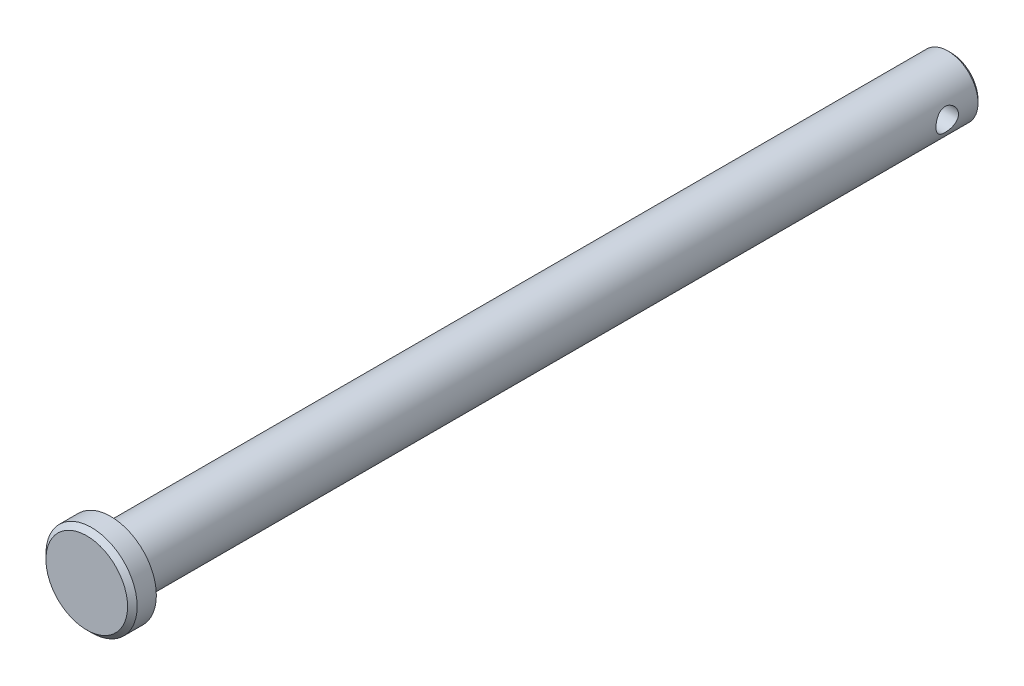
ISO-10303-21;
HEADER;
FILE_DESCRIPTION(('STEP AP214'),'2;1');
FILE_NAME('part.step','',(''),(''),'','','');
FILE_SCHEMA(('AUTOMOTIVE_DESIGN { 1 0 10303 214 1 1 1 1 }'));
ENDSEC;
DATA;
#1=APPLICATION_CONTEXT('core data for automotive mechanical design processes');
#2=APPLICATION_PROTOCOL_DEFINITION('international standard','automotive_design',2000,#1);
#3=PRODUCT_CONTEXT('',#1,'mechanical');
#4=PRODUCT('Part','Part','',(#3));
#5=PRODUCT_RELATED_PRODUCT_CATEGORY('part','',(#4));
#6=PRODUCT_DEFINITION_FORMATION('','',#4);
#7=PRODUCT_DEFINITION_CONTEXT('part definition',#1,'design');
#8=PRODUCT_DEFINITION('design','',#6,#7);
#9=PRODUCT_DEFINITION_SHAPE('','',#8);
#10=(LENGTH_UNIT() NAMED_UNIT(*) SI_UNIT(.MILLI.,.METRE.));
#11=(NAMED_UNIT(*) PLANE_ANGLE_UNIT() SI_UNIT($,.RADIAN.));
#12=(NAMED_UNIT(*) SI_UNIT($,.STERADIAN.) SOLID_ANGLE_UNIT());
#13=UNCERTAINTY_MEASURE_WITH_UNIT(LENGTH_MEASURE(1.E-05),#10,'distance_accuracy_value','');
#14=(GEOMETRIC_REPRESENTATION_CONTEXT(3) GLOBAL_UNCERTAINTY_ASSIGNED_CONTEXT((#13)) GLOBAL_UNIT_ASSIGNED_CONTEXT((#10,
#11,#12)) REPRESENTATION_CONTEXT('',''));
#15=CARTESIAN_POINT('',(0.,0.,0.));
#16=DIRECTION('',(0.,0.,1.));
#17=DIRECTION('',(1.,0.,0.));
#18=AXIS2_PLACEMENT_3D('',#15,#16,#17);
#19=CARTESIAN_POINT('',(0.,0.,44.45));
#20=DIRECTION('',(0.,0.,-1.));
#21=DIRECTION('',(-1.,0.,0.));
#22=AXIS2_PLACEMENT_3D('',#19,#20,#21);
#23=CYLINDRICAL_SURFACE('',#22,3.175);
#24=CARTESIAN_POINT('',(0.,0.,-44.1325));
#25=DIRECTION('',(0.,0.,1.));
#26=DIRECTION('',(1.,0.,0.));
#27=AXIS2_PLACEMENT_3D('',#24,#25,#26);
#28=CIRCLE('',#27,3.175);
#29=CARTESIAN_POINT('',(3.175,0.,-44.1325));
#30=VERTEX_POINT('',#29);
#31=EDGE_CURVE('E41',#30,#30,#28,.T.);
#32=ORIENTED_EDGE('',*,*,#31,.T.);
#33=EDGE_LOOP('',(#32));
#34=FACE_BOUND('',#33,.T.);
#35=CARTESIAN_POINT('',(-3.175,0.,-39.6875));
#36=CARTESIAN_POINT('',(-3.1750017260582,-0.0644803280319207,-39.6874976962969));
#37=CARTESIAN_POINT('',(-3.17301863556027,-0.128944879414297,-39.6927544346972));
#38=CARTESIAN_POINT('',(-3.16530589955499,-0.255947427804687,-39.7135573799955));
#39=CARTESIAN_POINT('',(-3.15957679372107,-0.318485700965171,-39.7291021047485));
#40=CARTESIAN_POINT('',(-3.14498698210789,-0.439785748086512,-39.7698539451563));
#41=CARTESIAN_POINT('',(-3.13613231952368,-0.498554552928811,-39.7950424227273));
#42=CARTESIAN_POINT('',(-3.11617334413749,-0.611028202439704,-39.8542719653313));
#43=CARTESIAN_POINT('',(-3.10506842811866,-0.664731683597443,-39.8883154047757));
#44=CARTESIAN_POINT('',(-3.08122833533403,-0.767831218530126,-39.9657986965375));
#45=CARTESIAN_POINT('',(-3.06844702050705,-0.816983642057511,-40.0095483956684));
#46=CARTESIAN_POINT('',(-3.04292175316615,-0.907450095452761,-40.1045445325105));
#47=CARTESIAN_POINT('',(-3.03017781325932,-0.948761726101174,-40.1557932563948));
#48=CARTESIAN_POINT('',(-3.00563336052824,-1.02392323008938,-40.2667132398466));
#49=CARTESIAN_POINT('',(-2.99388727501525,-1.05742893349134,-40.3266309659457));
#50=CARTESIAN_POINT('',(-2.97338639063463,-1.1137792552768,-40.4517608811213));
#51=CARTESIAN_POINT('',(-2.96463039737105,-1.13662813187984,-40.5169709432544));
#52=CARTESIAN_POINT('',(-2.95159440179158,-1.1700544212018,-40.6480301625799));
#53=CARTESIAN_POINT('',(-2.94714552453477,-1.1810967711723,-40.7137433742581));
#54=CARTESIAN_POINT('',(-2.94273336284839,-1.19205022996996,-40.8462290754076));
#55=CARTESIAN_POINT('',(-2.94276822592073,-1.19196593587088,-40.9130011160129));
#56=CARTESIAN_POINT('',(-2.94717399857943,-1.18102403502952,-41.0414545606378));
#57=CARTESIAN_POINT('',(-2.95128528416453,-1.17081148004022,-41.1032014691726));
#58=CARTESIAN_POINT('',(-2.96294919584751,-1.14096933245487,-41.2240310506342));
#59=CARTESIAN_POINT('',(-2.97050234018473,-1.12133832170211,-41.2831133208748));
#60=CARTESIAN_POINT('',(-2.98835526113513,-1.07286225428949,-41.3982511725093));
#61=CARTESIAN_POINT('',(-2.99870429903107,-1.04384989935074,-41.4542283421088));
#62=CARTESIAN_POINT('',(-3.02096654298085,-0.977551335491415,-41.5607069292128));
#63=CARTESIAN_POINT('',(-3.03288028850369,-0.940262269910621,-41.6112064471563));
#64=CARTESIAN_POINT('',(-3.05790630844421,-0.855517884834488,-41.7088666580229));
#65=CARTESIAN_POINT('',(-3.07104532042938,-0.80754774606584,-41.7555748585938));
#66=CARTESIAN_POINT('',(-3.09635309230243,-0.704304368962601,-41.8404182606759));
#67=CARTESIAN_POINT('',(-3.10852170288599,-0.649030010276034,-41.8785521445933));
#68=CARTESIAN_POINT('',(-3.13075950879707,-0.531592978112733,-41.9456635026684));
#69=CARTESIAN_POINT('',(-3.1407933299357,-0.469337004114246,-41.9744902675942));
#70=CARTESIAN_POINT('',(-3.15736857672026,-0.340389250103888,-42.0211111921394));
#71=CARTESIAN_POINT('',(-3.1639115533356,-0.273699454858827,-42.0389102518954));
#72=CARTESIAN_POINT('',(-3.17249526812277,-0.141585349249252,-42.0621005876114));
#73=CARTESIAN_POINT('',(-3.17475686664138,-0.0762822480275028,-42.0681011938161));
#74=CARTESIAN_POINT('',(-3.17520553124475,0.0544294022336763,-42.0692985319706));
#75=CARTESIAN_POINT('',(-3.17339350069573,0.119837924680553,-42.0644976592515));
#76=CARTESIAN_POINT('',(-3.16604419632035,0.246270501045977,-42.0446914039175));
#77=CARTESIAN_POINT('',(-3.16065273826329,0.307366454105824,-42.0300852121587));
#78=CARTESIAN_POINT('',(-3.1468335994155,0.426197517997295,-41.9916085549156));
#79=CARTESIAN_POINT('',(-3.13840552373861,0.483932190588357,-41.9677368845038));
#80=CARTESIAN_POINT('',(-3.11903764373597,0.596302913556189,-41.9106457851262));
#81=CARTESIAN_POINT('',(-3.1080313141617,0.650798072574004,-41.8771723024289));
#82=CARTESIAN_POINT('',(-3.08472420554452,0.753580464933013,-41.8021150056076));
#83=CARTESIAN_POINT('',(-3.07242294938803,0.801865395464673,-41.7605281972923));
#84=CARTESIAN_POINT('',(-3.04699455283473,0.893786946503484,-41.6675854780639));
#85=CARTESIAN_POINT('',(-3.03386090349835,0.93699134835583,-41.6158027674242));
#86=CARTESIAN_POINT('',(-3.00893809999065,1.01418270962824,-41.5054642133883));
#87=CARTESIAN_POINT('',(-2.99714906660554,1.04816884135274,-41.4469077624604));
#88=CARTESIAN_POINT('',(-2.9762992117158,1.10599357730705,-41.3241998104995));
#89=CARTESIAN_POINT('',(-2.96724991010741,1.12978950323492,-41.2600261079336));
#90=CARTESIAN_POINT('',(-2.95317888607235,1.16608132501844,-41.1281485000728));
#91=CARTESIAN_POINT('',(-2.94815467214383,1.17858421180019,-41.0604468062677));
#92=CARTESIAN_POINT('',(-2.94303366491605,1.1913103800891,-40.9281184233642));
#93=CARTESIAN_POINT('',(-2.94264115340402,1.19227069374821,-40.8635734735747));
#94=CARTESIAN_POINT('',(-2.94606990116576,1.18377268040514,-40.7352934052058));
#95=CARTESIAN_POINT('',(-2.94989076088501,1.17431534131036,-40.6715582104169));
#96=CARTESIAN_POINT('',(-2.96106962383437,1.14582428656504,-40.5486812637937));
#97=CARTESIAN_POINT('',(-2.96831611517726,1.12709164913741,-40.4894586876678));
#98=CARTESIAN_POINT('',(-2.98546478961414,1.08084696819061,-40.3749625026326));
#99=CARTESIAN_POINT('',(-2.99536764396202,1.0533327052505,-40.3196898963443));
#100=CARTESIAN_POINT('',(-3.01735905848772,0.988632102759095,-40.2115124856775));
#101=CARTESIAN_POINT('',(-3.02953498137515,0.951014360373894,-40.1588836800401));
#102=CARTESIAN_POINT('',(-3.0543995836351,0.867842480481129,-40.0604501359791));
#103=CARTESIAN_POINT('',(-3.06708842498621,0.822285820601664,-40.014647575013));
#104=CARTESIAN_POINT('',(-3.09237399534093,0.721582564947792,-39.9286396975664));
#105=CARTESIAN_POINT('',(-3.10492858264887,0.666050423844061,-39.8888713957112));
#106=CARTESIAN_POINT('',(-3.12780770850268,0.548650495915649,-39.8192445173742));
#107=CARTESIAN_POINT('',(-3.13813207344675,0.486782216434428,-39.7893867122343));
#108=CARTESIAN_POINT('',(-3.15574594756552,0.355599271339332,-39.7395883919429));
#109=CARTESIAN_POINT('',(-3.16288465369445,0.286078153898401,-39.7201333924723));
#110=CARTESIAN_POINT('',(-3.17250954730047,0.144363863550065,-39.694093713063));
#111=CARTESIAN_POINT('',(-3.17499806804399,0.0721720492396065,-39.6875025785069));
#112=CARTESIAN_POINT('',(-3.175,0.,-39.6875));
#113=B_SPLINE_CURVE_WITH_KNOTS('',3,(#35,#36,#37,#38,#39,#40,#41,#42,#43,#44,#45,#46,#47,#48,
#49,#50,#51,#52,#53,#54,#55,#56,#57,#58,#59,#60,#61,#62,#63,#64,#65,#66,#67,#68,#69,#70,#71,#72,
#73,#74,#75,#76,#77,#78,#79,#80,#81,#82,#83,#84,#85,#86,#87,#88,#89,#90,#91,#92,#93,#94,#95,#96,
#97,#98,#99,#100,#101,#102,#103,#104,#105,#106,#107,#108,#109,#110,#111,#112),.UNSPECIFIED.,.T.,
.F.,(4,2,2,2,2,2,2,2,2,2,2,2,2,2,2,2,2,2,2,2,2,2,2,2,2,2,2,2,2,2,2,2,2,2,2,2,2,2,4),(0.,
0.193174779988694,0.386321736189804,0.579097274313277,0.771924557565037,0.972134347500308,
1.17240530159713,1.38030485385691,1.58812126298256,1.78741287818416,1.98662215450768,
2.17390936438978,2.36122478335594,2.55208411657196,2.74300942653255,2.94676634210301,
3.15055454712147,3.35749404133323,3.5643415163596,3.76019234336017,3.95599974284977,
4.14428335102049,4.33259145270723,4.52643257351059,4.72034536640771,4.9255086231793,
5.13069029517863,5.33672309214719,5.54262825746729,5.73531018512452,5.92797384230188,
6.11475744301063,6.30158828783604,6.49821274558142,6.69489978960169,6.90223036662895,
7.10957707657801,7.32590383806685,7.54212202675677),.UNSPECIFIED.);
#114=CARTESIAN_POINT('',(-3.175,0.,-39.6875));
#115=VERTEX_POINT('',#114);
#116=EDGE_CURVE('E52',#115,#115,#113,.T.);
#117=ORIENTED_EDGE('',*,*,#116,.T.);
#118=EDGE_LOOP('',(#117));
#119=FACE_BOUND('',#118,.T.);
#120=CARTESIAN_POINT('',(3.175,0.,-42.06875));
#121=CARTESIAN_POINT('',(3.1750017260582,-0.0644803280319211,-42.0687523037031));
#122=CARTESIAN_POINT('',(3.17301863556027,-0.128944879414298,-42.0634955653029));
#123=CARTESIAN_POINT('',(3.16530589955499,-0.255947427804688,-42.0426926200045));
#124=CARTESIAN_POINT('',(3.15957679372107,-0.318485700965172,-42.0271478952515));
#125=CARTESIAN_POINT('',(3.14498698210789,-0.439785748086509,-41.9863960548437));
#126=CARTESIAN_POINT('',(3.13613231952368,-0.498554552928804,-41.9612075772727));
#127=CARTESIAN_POINT('',(3.11617334413749,-0.611028202439698,-41.9019780346687));
#128=CARTESIAN_POINT('',(3.10506842811866,-0.664731683597441,-41.8679345952243));
#129=CARTESIAN_POINT('',(3.08122833533403,-0.767831218530126,-41.7904513034625));
#130=CARTESIAN_POINT('',(3.06844702050705,-0.816983642057511,-41.7467016043316));
#131=CARTESIAN_POINT('',(3.04292175316615,-0.90745009545276,-41.6517054674895));
#132=CARTESIAN_POINT('',(3.03017781325932,-0.948761726101174,-41.6004567436053));
#133=CARTESIAN_POINT('',(3.00563336052824,-1.02392323008938,-41.4895367601535));
#134=CARTESIAN_POINT('',(2.99388727501525,-1.05742893349134,-41.4296190340543));
#135=CARTESIAN_POINT('',(2.97338639063463,-1.1137792552768,-41.3044891188787));
#136=CARTESIAN_POINT('',(2.96463039737105,-1.13662813187984,-41.2392790567456));
#137=CARTESIAN_POINT('',(2.95159440179158,-1.1700544212018,-41.1082198374201));
#138=CARTESIAN_POINT('',(2.94714552453477,-1.1810967711723,-41.0425066257419));
#139=CARTESIAN_POINT('',(2.94273336284839,-1.19205022996996,-40.9100209245924));
#140=CARTESIAN_POINT('',(2.94276822592073,-1.19196593587088,-40.8432488839871));
#141=CARTESIAN_POINT('',(2.94717399857943,-1.18102403502952,-40.7147954393622));
#142=CARTESIAN_POINT('',(2.95128528416453,-1.17081148004022,-40.6530485308274));
#143=CARTESIAN_POINT('',(2.96294919584751,-1.14096933245487,-40.5322189493658));
#144=CARTESIAN_POINT('',(2.97050234018473,-1.12133832170211,-40.4731366791252));
#145=CARTESIAN_POINT('',(2.98835526113513,-1.07286225428949,-40.3579988274907));
#146=CARTESIAN_POINT('',(2.99870429903107,-1.04384989935074,-40.3020216578912));
#147=CARTESIAN_POINT('',(3.02096654298085,-0.977551335491415,-40.1955430707872));
#148=CARTESIAN_POINT('',(3.03288028850369,-0.940262269910621,-40.1450435528437));
#149=CARTESIAN_POINT('',(3.05790630844421,-0.855517884834488,-40.0473833419771));
#150=CARTESIAN_POINT('',(3.07104532042938,-0.80754774606584,-40.0006751414062));
#151=CARTESIAN_POINT('',(3.09635309230243,-0.704304368962601,-39.9158317393242));
#152=CARTESIAN_POINT('',(3.10852170288599,-0.649030010276034,-39.8776978554068));
#153=CARTESIAN_POINT('',(3.13075950879707,-0.531592978112733,-39.8105864973316));
#154=CARTESIAN_POINT('',(3.1407933299357,-0.469337004114246,-39.7817597324058));
#155=CARTESIAN_POINT('',(3.15736857672026,-0.340389250103888,-39.7351388078607));
#156=CARTESIAN_POINT('',(3.1639115533356,-0.273699454858827,-39.7173397481046));
#157=CARTESIAN_POINT('',(3.17249526812277,-0.141585349249252,-39.6941494123886));
#158=CARTESIAN_POINT('',(3.17475686664138,-0.0762822480275028,-39.6881488061839));
#159=CARTESIAN_POINT('',(3.17520553124475,0.0544294022336763,-39.6869514680294));
#160=CARTESIAN_POINT('',(3.17339350069573,0.119837924680553,-39.6917523407486));
#161=CARTESIAN_POINT('',(3.16604419632035,0.246270501045977,-39.7115585960825));
#162=CARTESIAN_POINT('',(3.16065273826329,0.307366454105824,-39.7261647878413));
#163=CARTESIAN_POINT('',(3.1468335994155,0.426197517997295,-39.7646414450844));
#164=CARTESIAN_POINT('',(3.13840552373861,0.483932190588357,-39.7885131154963));
#165=CARTESIAN_POINT('',(3.11903764373597,0.596302913556189,-39.8456042148738));
#166=CARTESIAN_POINT('',(3.1080313141617,0.650798072574004,-39.8790776975711));
#167=CARTESIAN_POINT('',(3.08472420554452,0.753580464933013,-39.9541349943924));
#168=CARTESIAN_POINT('',(3.07242294938803,0.801865395464673,-39.9957218027077));
#169=CARTESIAN_POINT('',(3.04699455283473,0.893786946503484,-40.0886645219362));
#170=CARTESIAN_POINT('',(3.03386090349835,0.93699134835583,-40.1404472325758));
#171=CARTESIAN_POINT('',(3.00893809999065,1.01418270962824,-40.2507857866117));
#172=CARTESIAN_POINT('',(2.99714906660554,1.04816884135274,-40.3093422375396));
#173=CARTESIAN_POINT('',(2.9762992117158,1.10599357730705,-40.4320501895005));
#174=CARTESIAN_POINT('',(2.96724991010741,1.12978950323492,-40.4962238920664));
#175=CARTESIAN_POINT('',(2.95317888607235,1.16608132501844,-40.6281014999272));
#176=CARTESIAN_POINT('',(2.94815467214383,1.17858421180019,-40.6958031937323));
#177=CARTESIAN_POINT('',(2.94303366491605,1.1913103800891,-40.8281315766358));
#178=CARTESIAN_POINT('',(2.94264115340402,1.19227069374821,-40.8926765264253));
#179=CARTESIAN_POINT('',(2.94606990116576,1.18377268040514,-41.0209565947942));
#180=CARTESIAN_POINT('',(2.94989076088501,1.17431534131036,-41.0846917895831));
#181=CARTESIAN_POINT('',(2.96106962383437,1.14582428656504,-41.2075687362063));
#182=CARTESIAN_POINT('',(2.96831611517726,1.12709164913741,-41.2667913123323));
#183=CARTESIAN_POINT('',(2.98546478961414,1.08084696819061,-41.3812874973675));
#184=CARTESIAN_POINT('',(2.99536764396202,1.0533327052505,-41.4365601036557));
#185=CARTESIAN_POINT('',(3.01735905848772,0.988632102759095,-41.5447375143225));
#186=CARTESIAN_POINT('',(3.02953498137515,0.951014360373894,-41.5973663199599));
#187=CARTESIAN_POINT('',(3.0543995836351,0.867842480481129,-41.6957998640209));
#188=CARTESIAN_POINT('',(3.06708842498621,0.822285820601664,-41.741602424987));
#189=CARTESIAN_POINT('',(3.09237399534093,0.721582564947792,-41.8276103024336));
#190=CARTESIAN_POINT('',(3.10492858264887,0.666050423844061,-41.8673786042888));
#191=CARTESIAN_POINT('',(3.12780770850268,0.548650495915649,-41.9370054826258));
#192=CARTESIAN_POINT('',(3.13813207344675,0.486782216434428,-41.9668632877657));
#193=CARTESIAN_POINT('',(3.15574594756552,0.355599271339332,-42.0166616080571));
#194=CARTESIAN_POINT('',(3.16288465369445,0.286078153898401,-42.0361166075278));
#195=CARTESIAN_POINT('',(3.17250954730047,0.144363863550065,-42.0621562869371));
#196=CARTESIAN_POINT('',(3.17499806804399,0.0721720492396065,-42.0687474214931));
#197=CARTESIAN_POINT('',(3.175,0.,-42.06875));
#198=B_SPLINE_CURVE_WITH_KNOTS('',3,(#120,#121,#122,#123,#124,#125,#126,#127,#128,#129,#130,
#131,#132,#133,#134,#135,#136,#137,#138,#139,#140,#141,#142,#143,#144,#145,#146,#147,#148,#149,
#150,#151,#152,#153,#154,#155,#156,#157,#158,#159,#160,#161,#162,#163,#164,#165,#166,#167,#168,
#169,#170,#171,#172,#173,#174,#175,#176,#177,#178,#179,#180,#181,#182,#183,#184,#185,#186,#187,
#188,#189,#190,#191,#192,#193,#194,#195,#196,#197),.UNSPECIFIED.,.T.,.F.,(4,2,2,2,2,2,2,2,2,2,2,
2,2,2,2,2,2,2,2,2,2,2,2,2,2,2,2,2,2,2,2,2,2,2,2,2,2,2,4),(0.,0.193174779988695,
0.386321736189804,0.579097274313269,0.771924557565036,0.972134347500308,1.17240530159713,
1.38030485385691,1.58812126298256,1.78741287818416,1.98662215450768,2.17390936438978,
2.36122478335594,2.55208411657196,2.74300942653255,2.94676634210301,3.15055454712147,
3.35749404133323,3.56434151635959,3.76019234336016,3.95599974284976,4.14428335102049,
4.33259145270723,4.52643257351058,4.72034536640771,4.9255086231793,5.13069029517863,
5.3367230921472,5.54262825746729,5.73531018512452,5.92797384230188,6.11475744301062,
6.30158828783603,6.49821274558142,6.69489978960169,6.90223036662895,7.10957707657801,
7.32590383806685,7.54212202675677),.UNSPECIFIED.);
#199=CARTESIAN_POINT('',(3.175,0.,-42.06875));
#200=VERTEX_POINT('',#199);
#201=EDGE_CURVE('E61',#200,#200,#198,.T.);
#202=ORIENTED_EDGE('',*,*,#201,.T.);
#203=EDGE_LOOP('',(#202));
#204=FACE_BOUND('',#203,.T.);
#205=CARTESIAN_POINT('',(0.,0.,44.45));
#206=DIRECTION('',(0.,0.,1.));
#207=DIRECTION('',(1.,0.,0.));
#208=AXIS2_PLACEMENT_3D('',#205,#206,#207);
#209=CIRCLE('',#208,3.175);
#210=CARTESIAN_POINT('',(3.175,0.,44.45));
#211=VERTEX_POINT('',#210);
#212=EDGE_CURVE('E100',#211,#211,#209,.T.);
#213=ORIENTED_EDGE('',*,*,#212,.F.);
#214=EDGE_LOOP('',(#213));
#215=FACE_BOUND('',#214,.T.);
#216=ADVANCED_FACE('F34',(#34,#119,#204,#215),#23,.T.);
#217=CARTESIAN_POINT('',(0.,0.,-44.45));
#218=DIRECTION('',(0.,0.,1.));
#219=DIRECTION('',(1.,0.,0.));
#220=AXIS2_PLACEMENT_3D('',#217,#218,#219);
#221=PLANE('',#220);
#222=CARTESIAN_POINT('',(0.,0.,-44.45));
#223=DIRECTION('',(0.,0.,1.));
#224=DIRECTION('',(1.,0.,0.));
#225=AXIS2_PLACEMENT_3D('',#222,#223,#224);
#226=CIRCLE('',#225,2.85750000000003);
#227=CARTESIAN_POINT('',(2.85750000000003,0.,-44.45));
#228=VERTEX_POINT('',#227);
#229=EDGE_CURVE('E10',#228,#228,#226,.F.);
#230=ORIENTED_EDGE('',*,*,#229,.T.);
#231=EDGE_LOOP('',(#230));
#232=FACE_BOUND('',#231,.T.);
#233=ADVANCED_FACE('F82',(#232),#221,.F.);
#234=CARTESIAN_POINT('',(0.,0.,44.45));
#235=DIRECTION('',(0.,0.,1.));
#236=DIRECTION('',(1.,0.,0.));
#237=AXIS2_PLACEMENT_3D('',#234,#235,#236);
#238=PLANE('',#237);
#239=CARTESIAN_POINT('',(0.,0.,44.45));
#240=DIRECTION('',(0.,0.,1.));
#241=DIRECTION('',(1.,0.,0.));
#242=AXIS2_PLACEMENT_3D('',#239,#240,#241);
#243=CIRCLE('',#242,4.826);
#244=CARTESIAN_POINT('',(4.826,0.,44.45));
#245=VERTEX_POINT('',#244);
#246=EDGE_CURVE('E60',#245,#245,#243,.T.);
#247=ORIENTED_EDGE('',*,*,#246,.F.);
#248=EDGE_LOOP('',(#247));
#249=FACE_BOUND('',#248,.T.);
#250=ORIENTED_EDGE('',*,*,#212,.T.);
#251=EDGE_LOOP('',(#250));
#252=FACE_BOUND('',#251,.T.);
#253=ADVANCED_FACE('F79',(#249,#252),#238,.F.);
#254=CARTESIAN_POINT('',(0.,0.,46.99));
#255=DIRECTION('',(0.,0.,-1.));
#256=DIRECTION('',(-1.,0.,0.));
#257=AXIS2_PLACEMENT_3D('',#254,#255,#256);
#258=CYLINDRICAL_SURFACE('',#257,4.826);
#259=CARTESIAN_POINT('',(0.,0.,46.482));
#260=DIRECTION('',(0.,0.,1.));
#261=DIRECTION('',(1.,0.,0.));
#262=AXIS2_PLACEMENT_3D('',#259,#260,#261);
#263=CIRCLE('',#262,4.826);
#264=CARTESIAN_POINT('',(4.826,0.,46.482));
#265=VERTEX_POINT('',#264);
#266=EDGE_CURVE('E45',#265,#265,#263,.F.);
#267=ORIENTED_EDGE('',*,*,#266,.T.);
#268=EDGE_LOOP('',(#267));
#269=FACE_BOUND('',#268,.T.);
#270=ORIENTED_EDGE('',*,*,#246,.T.);
#271=EDGE_LOOP('',(#270));
#272=FACE_BOUND('',#271,.T.);
#273=ADVANCED_FACE('F77',(#269,#272),#258,.T.);
#274=CARTESIAN_POINT('',(0.,0.,46.99));
#275=DIRECTION('',(0.,0.,1.));
#276=DIRECTION('',(1.,0.,0.));
#277=AXIS2_PLACEMENT_3D('',#274,#275,#276);
#278=PLANE('',#277);
#279=CARTESIAN_POINT('',(0.,0.,46.99));
#280=DIRECTION('',(0.,0.,1.));
#281=DIRECTION('',(1.,0.,0.));
#282=AXIS2_PLACEMENT_3D('',#279,#280,#281);
#283=CIRCLE('',#282,4.31799999999996);
#284=CARTESIAN_POINT('',(4.31799999999996,0.,46.99));
#285=VERTEX_POINT('',#284);
#286=EDGE_CURVE('E49',#285,#285,#283,.T.);
#287=ORIENTED_EDGE('',*,*,#286,.T.);
#288=EDGE_LOOP('',(#287));
#289=FACE_BOUND('',#288,.T.);
#290=ADVANCED_FACE('F73',(#289),#278,.T.);
#291=CARTESIAN_POINT('',(0.,0.,46.99));
#292=DIRECTION('',(0.,0.,-1.));
#293=DIRECTION('',(-1.,0.,0.));
#294=AXIS2_PLACEMENT_3D('',#291,#292,#293);
#295=CONICAL_SURFACE('',#294,4.31799999999996,0.785398163397458);
#296=ORIENTED_EDGE('',*,*,#266,.F.);
#297=EDGE_LOOP('',(#296));
#298=FACE_BOUND('',#297,.T.);
#299=ORIENTED_EDGE('',*,*,#286,.F.);
#300=EDGE_LOOP('',(#299));
#301=FACE_BOUND('',#300,.T.);
#302=ADVANCED_FACE('F71',(#298,#301),#295,.T.);
#303=CARTESIAN_POINT('',(-4.826,0.,-40.878125));
#304=DIRECTION('',(1.,0.,0.));
#305=DIRECTION('',(0.,0.,-1.));
#306=AXIS2_PLACEMENT_3D('',#303,#304,#305);
#307=CYLINDRICAL_SURFACE('',#306,1.190625);
#308=ORIENTED_EDGE('',*,*,#201,.F.);
#309=EDGE_LOOP('',(#308));
#310=FACE_BOUND('',#309,.T.);
#311=ORIENTED_EDGE('',*,*,#116,.F.);
#312=EDGE_LOOP('',(#311));
#313=FACE_BOUND('',#312,.T.);
#314=ADVANCED_FACE('F67',(#310,#313),#307,.F.);
#315=CARTESIAN_POINT('',(0.,0.,-44.1325));
#316=DIRECTION('',(0.,0.,1.));
#317=DIRECTION('',(1.,0.,0.));
#318=AXIS2_PLACEMENT_3D('',#315,#316,#317);
#319=CONICAL_SURFACE('',#318,3.175,0.785398163397452);
#320=ORIENTED_EDGE('',*,*,#229,.F.);
#321=EDGE_LOOP('',(#320));
#322=FACE_BOUND('',#321,.T.);
#323=ORIENTED_EDGE('',*,*,#31,.F.);
#324=EDGE_LOOP('',(#323));
#325=FACE_BOUND('',#324,.T.);
#326=ADVANCED_FACE('F36',(#322,#325),#319,.T.);
#327=CLOSED_SHELL('',(#216,#233,#253,#273,#290,#302,#314,#326));
#328=MANIFOLD_SOLID_BREP('B2',#327);
#329=ADVANCED_BREP_SHAPE_REPRESENTATION('',(#18,#328),#14);
#330=SHAPE_DEFINITION_REPRESENTATION(#9,#329);
ENDSEC;
END-ISO-10303-21;
